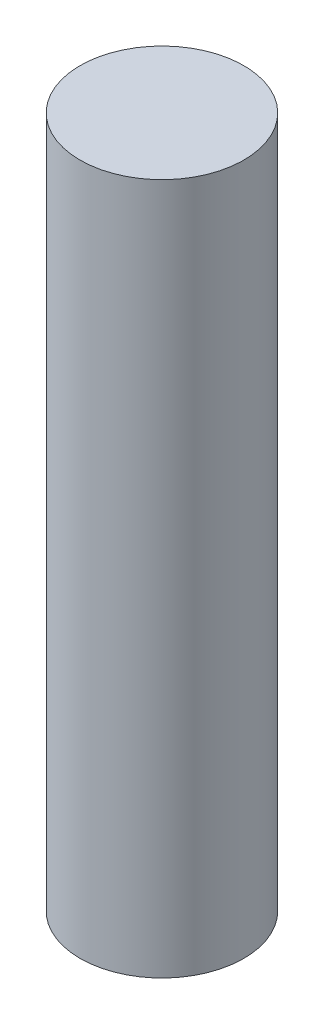
ISO-10303-21;
HEADER;
FILE_DESCRIPTION(('STEP AP214'),'2;1');
FILE_NAME('part.step','',(''),(''),'','','');
FILE_SCHEMA(('AUTOMOTIVE_DESIGN { 1 0 10303 214 1 1 1 1 }'));
ENDSEC;
DATA;
#1=APPLICATION_CONTEXT('core data for automotive mechanical design processes');
#2=APPLICATION_PROTOCOL_DEFINITION('international standard','automotive_design',2000,#1);
#3=PRODUCT_CONTEXT('',#1,'mechanical');
#4=PRODUCT('Part','Part','',(#3));
#5=PRODUCT_RELATED_PRODUCT_CATEGORY('part','',(#4));
#6=PRODUCT_DEFINITION_FORMATION('','',#4);
#7=PRODUCT_DEFINITION_CONTEXT('part definition',#1,'design');
#8=PRODUCT_DEFINITION('design','',#6,#7);
#9=PRODUCT_DEFINITION_SHAPE('','',#8);
#10=(LENGTH_UNIT() NAMED_UNIT(*) SI_UNIT(.MILLI.,.METRE.));
#11=(NAMED_UNIT(*) PLANE_ANGLE_UNIT() SI_UNIT($,.RADIAN.));
#12=(NAMED_UNIT(*) SI_UNIT($,.STERADIAN.) SOLID_ANGLE_UNIT());
#13=UNCERTAINTY_MEASURE_WITH_UNIT(LENGTH_MEASURE(1.E-05),#10,'distance_accuracy_value','');
#14=(GEOMETRIC_REPRESENTATION_CONTEXT(3) GLOBAL_UNCERTAINTY_ASSIGNED_CONTEXT((#13)) GLOBAL_UNIT_ASSIGNED_CONTEXT((#10,
#11,#12)) REPRESENTATION_CONTEXT('',''));
#15=CARTESIAN_POINT('',(0.,0.,0.));
#16=DIRECTION('',(0.,0.,1.));
#17=DIRECTION('',(1.,0.,0.));
#18=AXIS2_PLACEMENT_3D('',#15,#16,#17);
#19=CARTESIAN_POINT('',(0.,76.,0.));
#20=DIRECTION('',(0.,-1.,0.));
#21=DIRECTION('',(0.,0.,-1.));
#22=AXIS2_PLACEMENT_3D('',#19,#20,#21);
#23=CYLINDRICAL_SURFACE('',#22,9.);
#24=CARTESIAN_POINT('',(0.,76.,0.));
#25=DIRECTION('',(0.,1.,0.));
#26=DIRECTION('',(0.,0.,1.));
#27=AXIS2_PLACEMENT_3D('',#24,#25,#26);
#28=CIRCLE('',#27,9.);
#29=CARTESIAN_POINT('',(0.,76.,9.));
#30=VERTEX_POINT('',#29);
#31=EDGE_CURVE('E10',#30,#30,#28,.T.);
#32=ORIENTED_EDGE('',*,*,#31,.F.);
#33=EDGE_LOOP('',(#32));
#34=FACE_BOUND('',#33,.T.);
#35=CARTESIAN_POINT('',(0.,0.,0.));
#36=DIRECTION('',(0.,1.,0.));
#37=DIRECTION('',(0.,0.,1.));
#38=AXIS2_PLACEMENT_3D('',#35,#36,#37);
#39=CIRCLE('',#38,9.);
#40=CARTESIAN_POINT('',(0.,0.,9.));
#41=VERTEX_POINT('',#40);
#42=EDGE_CURVE('E44',#41,#41,#39,.T.);
#43=ORIENTED_EDGE('',*,*,#42,.T.);
#44=EDGE_LOOP('',(#43));
#45=FACE_BOUND('',#44,.T.);
#46=ADVANCED_FACE('F41',(#34,#45),#23,.T.);
#47=CARTESIAN_POINT('',(0.,76.,0.));
#48=DIRECTION('',(0.,1.,0.));
#49=DIRECTION('',(0.,0.,1.));
#50=AXIS2_PLACEMENT_3D('',#47,#48,#49);
#51=PLANE('',#50);
#52=ORIENTED_EDGE('',*,*,#31,.T.);
#53=EDGE_LOOP('',(#52));
#54=FACE_BOUND('',#53,.T.);
#55=ADVANCED_FACE('F58',(#54),#51,.T.);
#56=CARTESIAN_POINT('',(0.,0.,0.));
#57=DIRECTION('',(0.,1.,0.));
#58=DIRECTION('',(0.,0.,1.));
#59=AXIS2_PLACEMENT_3D('',#56,#57,#58);
#60=PLANE('',#59);
#61=ORIENTED_EDGE('',*,*,#42,.F.);
#62=EDGE_LOOP('',(#61));
#63=FACE_BOUND('',#62,.T.);
#64=ADVANCED_FACE('F56',(#63),#60,.F.);
#65=CLOSED_SHELL('',(#46,#55,#64));
#66=MANIFOLD_SOLID_BREP('B2',#65);
#67=ADVANCED_BREP_SHAPE_REPRESENTATION('',(#18,#66),#14);
#68=SHAPE_DEFINITION_REPRESENTATION(#9,#67);
ENDSEC;
END-ISO-10303-21;
